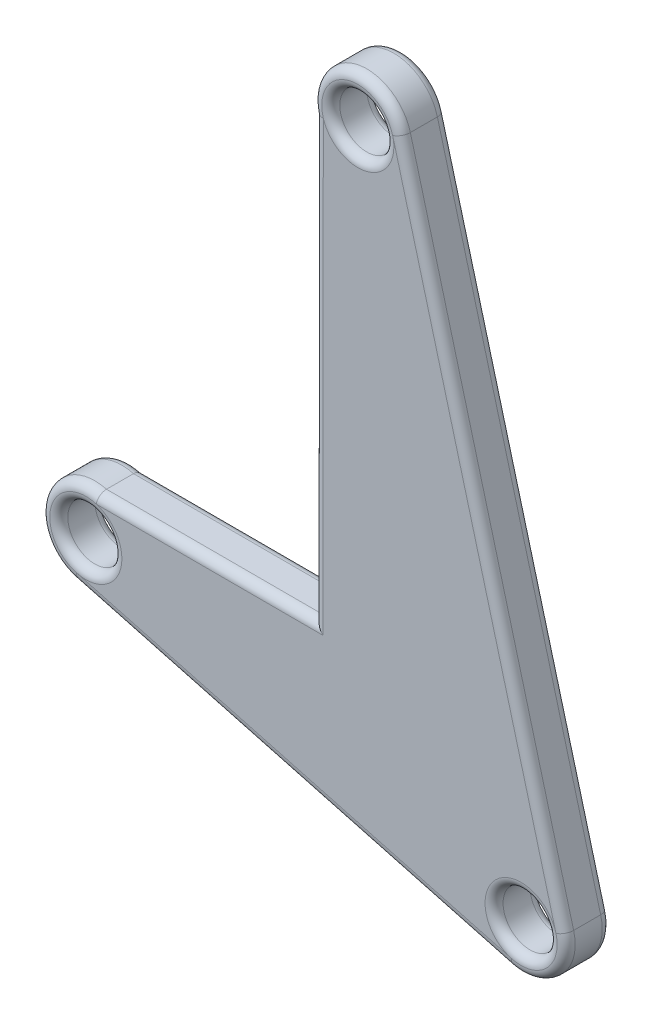
ISO-10303-21;
HEADER;
FILE_DESCRIPTION(('STEP AP214'),'2;1');
FILE_NAME('part.step','',(''),(''),'','','');
FILE_SCHEMA(('AUTOMOTIVE_DESIGN { 1 0 10303 214 1 1 1 1 }'));
ENDSEC;
DATA;
#1=APPLICATION_CONTEXT('core data for automotive mechanical design processes');
#2=APPLICATION_PROTOCOL_DEFINITION('international standard','automotive_design',2000,#1);
#3=PRODUCT_CONTEXT('',#1,'mechanical');
#4=PRODUCT('Part','Part','',(#3));
#5=PRODUCT_RELATED_PRODUCT_CATEGORY('part','',(#4));
#6=PRODUCT_DEFINITION_FORMATION('','',#4);
#7=PRODUCT_DEFINITION_CONTEXT('part definition',#1,'design');
#8=PRODUCT_DEFINITION('design','',#6,#7);
#9=PRODUCT_DEFINITION_SHAPE('','',#8);
#10=(LENGTH_UNIT() NAMED_UNIT(*) SI_UNIT(.MILLI.,.METRE.));
#11=(NAMED_UNIT(*) PLANE_ANGLE_UNIT() SI_UNIT($,.RADIAN.));
#12=(NAMED_UNIT(*) SI_UNIT($,.STERADIAN.) SOLID_ANGLE_UNIT());
#13=UNCERTAINTY_MEASURE_WITH_UNIT(LENGTH_MEASURE(1.E-05),#10,'distance_accuracy_value','');
#14=(GEOMETRIC_REPRESENTATION_CONTEXT(3) GLOBAL_UNCERTAINTY_ASSIGNED_CONTEXT((#13)) GLOBAL_UNIT_ASSIGNED_CONTEXT((#10,
#11,#12)) REPRESENTATION_CONTEXT('',''));
#15=CARTESIAN_POINT('',(0.,0.,0.));
#16=DIRECTION('',(0.,0.,1.));
#17=DIRECTION('',(1.,0.,0.));
#18=AXIS2_PLACEMENT_3D('',#15,#16,#17);
#19=CARTESIAN_POINT('',(58.3955766792557,15.6470476127568,2.5));
#20=DIRECTION('',(0.965925826289066,0.258819045102528,0.));
#21=DIRECTION('',(-0.258819045102528,0.965925826289066,0.));
#22=AXIS2_PLACEMENT_3D('',#19,#20,#21);
#23=PLANE('',#22);
#24=DIRECTION('',(0.,0.,-1.));
#25=VECTOR('',#24,1.);
#26=CARTESIAN_POINT('',(54.3763387927888,30.6470476127566,2.5));
#27=LINE('',#26,#25);
#28=CARTESIAN_POINT('',(54.3763387927888,30.6470476127566,2.));
#29=VERTEX_POINT('',#28);
#30=CARTESIAN_POINT('',(54.3763387927888,30.6470476127566,0.5));
#31=VERTEX_POINT('',#30);
#32=EDGE_CURVE('E190',#29,#31,#27,.T.);
#33=ORIENTED_EDGE('',*,*,#32,.T.);
#34=DIRECTION('',(0.258819045102528,-0.965925826289066,0.));
#35=VECTOR('',#34,1.);
#36=CARTESIAN_POINT('',(45.3176722142003,64.4544515328739,0.5));
#37=LINE('',#36,#35);
#38=CARTESIAN_POINT('',(45.3176722142003,64.4544515328739,0.5));
#39=VERTEX_POINT('',#38);
#40=EDGE_CURVE('E345',#31,#39,#37,.F.);
#41=ORIENTED_EDGE('',*,*,#40,.T.);
#42=DIRECTION('',(0.,0.,-1.));
#43=VECTOR('',#42,1.);
#44=CARTESIAN_POINT('',(45.3176722142003,64.4544515328739,2.5));
#45=LINE('',#44,#43);
#46=CARTESIAN_POINT('',(45.3176722142003,64.4544515328739,2.));
#47=VERTEX_POINT('',#46);
#48=EDGE_CURVE('E179',#47,#39,#45,.T.);
#49=ORIENTED_EDGE('',*,*,#48,.F.);
#50=DIRECTION('',(0.258819045102528,-0.965925826289066,0.));
#51=VECTOR('',#50,1.);
#52=CARTESIAN_POINT('',(58.3955766792557,15.6470476127568,2.));
#53=LINE('',#52,#51);
#54=EDGE_CURVE('E349',#47,#29,#53,.T.);
#55=ORIENTED_EDGE('',*,*,#54,.T.);
#56=EDGE_LOOP('',(#33,#41,#49,#55));
#57=FACE_BOUND('',#56,.T.);
#58=ADVANCED_FACE('F43',(#57),#23,.T.);
#59=CARTESIAN_POINT('',(42.9028576484777,63.8074039201176,2.5));
#60=DIRECTION('',(0.,0.,-1.));
#61=DIRECTION('',(-1.,0.,0.));
#62=AXIS2_PLACEMENT_3D('',#59,#60,#61);
#63=CYLINDRICAL_SURFACE('',#62,2.49999999999999);
#64=ORIENTED_EDGE('',*,*,#48,.T.);
#65=CARTESIAN_POINT('',(42.9028576484777,63.8074039201176,0.5));
#66=DIRECTION('',(0.,0.,1.));
#67=DIRECTION('',(1.,0.,0.));
#68=AXIS2_PLACEMENT_3D('',#65,#66,#67);
#69=CIRCLE('',#68,2.49999999999999);
#70=CARTESIAN_POINT('',(40.488043082755,63.1603563073612,0.5));
#71=VERTEX_POINT('',#70);
#72=EDGE_CURVE('E455',#39,#71,#69,.T.);
#73=ORIENTED_EDGE('',*,*,#72,.T.);
#74=DIRECTION('',(0.,0.,-1.));
#75=VECTOR('',#74,1.);
#76=CARTESIAN_POINT('',(40.488043082755,63.1603563073612,2.5));
#77=LINE('',#76,#75);
#78=CARTESIAN_POINT('',(40.488043082755,63.1603563073612,2.));
#79=VERTEX_POINT('',#78);
#80=EDGE_CURVE('E429',#79,#71,#77,.T.);
#81=ORIENTED_EDGE('',*,*,#80,.F.);
#82=CARTESIAN_POINT('',(42.9028576484777,63.8074039201176,2.));
#83=DIRECTION('',(0.,0.,1.));
#84=DIRECTION('',(1.,0.,0.));
#85=AXIS2_PLACEMENT_3D('',#82,#83,#84);
#86=CIRCLE('',#85,2.49999999999999);
#87=EDGE_CURVE('E453',#79,#47,#86,.F.);
#88=ORIENTED_EDGE('',*,*,#87,.T.);
#89=EDGE_LOOP('',(#64,#73,#81,#88));
#90=FACE_BOUND('',#89,.T.);
#91=ADVANCED_FACE('F288',(#90),#63,.T.);
#92=CARTESIAN_POINT('',(40.4161758500665,-0.0459542518539564,2.5));
#93=DIRECTION('',(-0.999999353586309,0.00113702548996662,0.));
#94=DIRECTION('',(-0.00113702548996662,-0.999999353586309,0.));
#95=AXIS2_PLACEMENT_3D('',#92,#93,#94);
#96=PLANE('',#95);
#97=ORIENTED_EDGE('',*,*,#80,.T.);
#98=DIRECTION('',(0.00113702548996662,0.999999353586309,0.));
#99=VECTOR('',#98,1.);
#100=CARTESIAN_POINT('',(40.4604261825957,38.8716463785862,0.5));
#101=LINE('',#100,#99);
#102=CARTESIAN_POINT('',(40.4604261825957,38.8716463785862,0.5));
#103=VERTEX_POINT('',#102);
#104=EDGE_CURVE('E193',#71,#103,#101,.F.);
#105=ORIENTED_EDGE('',*,*,#104,.T.);
#106=DIRECTION('',(0.,0.,-1.));
#107=VECTOR('',#106,1.);
#108=CARTESIAN_POINT('',(40.4604261825957,38.8716463785862,2.5));
#109=LINE('',#108,#107);
#110=CARTESIAN_POINT('',(40.4604261825957,38.8716463785862,2.));
#111=VERTEX_POINT('',#110);
#112=EDGE_CURVE('E426',#111,#103,#109,.T.);
#113=ORIENTED_EDGE('',*,*,#112,.F.);
#114=DIRECTION('',(0.00113702548996662,0.999999353586309,0.));
#115=VECTOR('',#114,1.);
#116=CARTESIAN_POINT('',(40.4161758500665,-0.0459542518539564,2.));
#117=LINE('',#116,#115);
#118=EDGE_CURVE('E457',#111,#79,#117,.T.);
#119=ORIENTED_EDGE('',*,*,#118,.T.);
#120=EDGE_LOOP('',(#97,#105,#113,#119));
#121=FACE_BOUND('',#120,.T.);
#122=ADVANCED_FACE('F294',(#121),#96,.T.);
#123=CARTESIAN_POINT('',(0.0442503325291617,38.9176006304402,2.5));
#124=DIRECTION('',(0.00113702548996635,0.999999353586309,0.));
#125=DIRECTION('',(-0.999999353586309,0.00113702548996635,0.));
#126=AXIS2_PLACEMENT_3D('',#123,#124,#125);
#127=PLANE('',#126);
#128=ORIENTED_EDGE('',*,*,#112,.T.);
#129=DIRECTION('',(0.999999353586309,-0.00113702548996635,0.));
#130=VECTOR('',#129,1.);
#131=CARTESIAN_POINT('',(28.4604261825957,38.8852906932857,0.5));
#132=LINE('',#131,#130);
#133=CARTESIAN_POINT('',(28.4604261825957,38.8852906932857,0.5));
#134=VERTEX_POINT('',#133);
#135=EDGE_CURVE('E462',#103,#134,#132,.F.);
#136=ORIENTED_EDGE('',*,*,#135,.T.);
#137=DIRECTION('',(0.,0.,-1.));
#138=VECTOR('',#137,1.);
#139=CARTESIAN_POINT('',(28.4604261825957,38.8852906932857,2.5));
#140=LINE('',#139,#138);
#141=CARTESIAN_POINT('',(28.4604261825957,38.8852906932857,2.));
#142=VERTEX_POINT('',#141);
#143=EDGE_CURVE('E420',#142,#134,#140,.T.);
#144=ORIENTED_EDGE('',*,*,#143,.F.);
#145=DIRECTION('',(0.999999353586309,-0.00113702548996635,0.));
#146=VECTOR('',#145,1.);
#147=CARTESIAN_POINT('',(0.0442503325291617,38.9176006304402,2.));
#148=LINE('',#147,#146);
#149=EDGE_CURVE('E460',#142,#111,#148,.T.);
#150=ORIENTED_EDGE('',*,*,#149,.T.);
#151=EDGE_LOOP('',(#128,#136,#144,#150));
#152=FACE_BOUND('',#151,.T.);
#153=ADVANCED_FACE('F503',(#152),#127,.T.);
#154=CARTESIAN_POINT('',(27.8133785698394,36.470476127563,2.5));
#155=DIRECTION('',(0.,0.,-1.));
#156=DIRECTION('',(-1.,0.,0.));
#157=AXIS2_PLACEMENT_3D('',#154,#155,#156);
#158=CYLINDRICAL_SURFACE('',#157,2.49999999999999);
#159=ORIENTED_EDGE('',*,*,#143,.T.);
#160=CARTESIAN_POINT('',(27.8133785698394,36.470476127563,0.5));
#161=DIRECTION('',(0.,0.,1.));
#162=DIRECTION('',(1.,0.,0.));
#163=AXIS2_PLACEMENT_3D('',#160,#161,#162);
#164=CIRCLE('',#163,2.49999999999999);
#165=CARTESIAN_POINT('',(27.1663309570831,34.0556615618403,0.5));
#166=VERTEX_POINT('',#165);
#167=EDGE_CURVE('E466',#134,#166,#164,.T.);
#168=ORIENTED_EDGE('',*,*,#167,.T.);
#169=DIRECTION('',(0.,0.,-1.));
#170=VECTOR('',#169,1.);
#171=CARTESIAN_POINT('',(27.1663309570831,34.0556615618403,2.5));
#172=LINE('',#171,#170);
#173=CARTESIAN_POINT('',(27.1663309570831,34.0556615618403,2.));
#174=VERTEX_POINT('',#173);
#175=EDGE_CURVE('E418',#174,#166,#172,.T.);
#176=ORIENTED_EDGE('',*,*,#175,.F.);
#177=CARTESIAN_POINT('',(27.8133785698394,36.470476127563,2.));
#178=DIRECTION('',(0.,0.,1.));
#179=DIRECTION('',(1.,0.,0.));
#180=AXIS2_PLACEMENT_3D('',#177,#178,#179);
#181=CIRCLE('',#180,2.49999999999999);
#182=EDGE_CURVE('E464',#174,#142,#181,.F.);
#183=ORIENTED_EDGE('',*,*,#182,.T.);
#184=EDGE_LOOP('',(#159,#168,#176,#183));
#185=FACE_BOUND('',#184,.T.);
#186=ADVANCED_FACE('F500',(#185),#158,.T.);
#187=CARTESIAN_POINT('',(10.3337145007764,38.5659475478104,2.5));
#188=DIRECTION('',(0.258819045102511,0.965925826289071,0.));
#189=DIRECTION('',(-0.965925826289071,0.258819045102511,0.));
#190=AXIS2_PLACEMENT_3D('',#187,#188,#189);
#191=PLANE('',#190);
#192=ORIENTED_EDGE('',*,*,#175,.T.);
#193=DIRECTION('',(0.965925826289071,-0.258819045102511,0.));
#194=VECTOR('',#193,1.);
#195=CARTESIAN_POINT('',(10.3337145007764,38.5659475478104,0.5));
#196=LINE('',#195,#194);
#197=CARTESIAN_POINT('',(51.3144766143099,27.5851854342776,0.5));
#198=VERTEX_POINT('',#197);
#199=EDGE_CURVE('E411',#166,#198,#196,.T.);
#200=ORIENTED_EDGE('',*,*,#199,.T.);
#201=DIRECTION('',(0.,0.,-1.));
#202=VECTOR('',#201,1.);
#203=CARTESIAN_POINT('',(51.3144766143099,27.5851854342776,2.5));
#204=LINE('',#203,#202);
#205=CARTESIAN_POINT('',(51.3144766143099,27.5851854342776,2.));
#206=VERTEX_POINT('',#205);
#207=EDGE_CURVE('E410',#206,#198,#204,.T.);
#208=ORIENTED_EDGE('',*,*,#207,.F.);
#209=DIRECTION('',(0.965925826289071,-0.258819045102511,0.));
#210=VECTOR('',#209,1.);
#211=CARTESIAN_POINT('',(27.1663309570831,34.0556615618403,2.));
#212=LINE('',#211,#210);
#213=EDGE_CURVE('E405',#206,#174,#212,.F.);
#214=ORIENTED_EDGE('',*,*,#213,.T.);
#215=EDGE_LOOP('',(#192,#200,#208,#214));
#216=FACE_BOUND('',#215,.T.);
#217=ADVANCED_FACE('F415',(#216),#191,.F.);
#218=CARTESIAN_POINT('',(51.9615242270662,30.0000000000003,2.5));
#219=DIRECTION('',(0.,0.,-1.));
#220=DIRECTION('',(-1.,0.,0.));
#221=AXIS2_PLACEMENT_3D('',#218,#219,#220);
#222=CYLINDRICAL_SURFACE('',#221,1.50000000000001);
#223=CARTESIAN_POINT('',(51.9615242270662,30.0000000000003,0.5));
#224=DIRECTION('',(0.,0.,1.));
#225=DIRECTION('',(1.,0.,0.));
#226=AXIS2_PLACEMENT_3D('',#223,#224,#225);
#227=CIRCLE('',#226,1.50000000000001);
#228=CARTESIAN_POINT('',(53.4615242270662,30.0000000000003,0.5));
#229=VERTEX_POINT('',#228);
#230=EDGE_CURVE('E450',#229,#229,#227,.F.);
#231=ORIENTED_EDGE('',*,*,#230,.T.);
#232=EDGE_LOOP('',(#231));
#233=FACE_BOUND('',#232,.T.);
#234=CARTESIAN_POINT('',(51.9615242270662,30.0000000000003,2.));
#235=DIRECTION('',(0.,0.,1.));
#236=DIRECTION('',(1.,0.,0.));
#237=AXIS2_PLACEMENT_3D('',#234,#235,#236);
#238=CIRCLE('',#237,1.50000000000001);
#239=CARTESIAN_POINT('',(53.4615242270662,30.0000000000003,2.));
#240=VERTEX_POINT('',#239);
#241=EDGE_CURVE('E447',#240,#240,#238,.T.);
#242=ORIENTED_EDGE('',*,*,#241,.T.);
#243=EDGE_LOOP('',(#242));
#244=FACE_BOUND('',#243,.T.);
#245=ADVANCED_FACE('F492',(#233,#244),#222,.F.);
#246=CARTESIAN_POINT('',(51.9615242270662,30.0000000000002,2.5));
#247=DIRECTION('',(0.,0.,-1.));
#248=DIRECTION('',(-1.,0.,0.));
#249=AXIS2_PLACEMENT_3D('',#246,#247,#248);
#250=CYLINDRICAL_SURFACE('',#249,2.5);
#251=ORIENTED_EDGE('',*,*,#207,.T.);
#252=CARTESIAN_POINT('',(51.9615242270662,30.0000000000002,0.5));
#253=DIRECTION('',(0.,0.,1.));
#254=DIRECTION('',(1.,0.,0.));
#255=AXIS2_PLACEMENT_3D('',#252,#253,#254);
#256=CIRCLE('',#255,2.5);
#257=EDGE_CURVE('E354',#198,#31,#256,.T.);
#258=ORIENTED_EDGE('',*,*,#257,.T.);
#259=ORIENTED_EDGE('',*,*,#32,.F.);
#260=CARTESIAN_POINT('',(51.9615242270662,30.0000000000002,2.));
#261=DIRECTION('',(0.,0.,1.));
#262=DIRECTION('',(1.,0.,0.));
#263=AXIS2_PLACEMENT_3D('',#260,#261,#262);
#264=CIRCLE('',#263,2.5);
#265=EDGE_CURVE('E394',#29,#206,#264,.F.);
#266=ORIENTED_EDGE('',*,*,#265,.T.);
#267=EDGE_LOOP('',(#251,#258,#259,#266));
#268=FACE_BOUND('',#267,.T.);
#269=ADVANCED_FACE('F304',(#268),#250,.T.);
#270=CARTESIAN_POINT('',(42.9028576484777,63.8074039201176,2.5));
#271=DIRECTION('',(0.,0.,-1.));
#272=DIRECTION('',(-1.,0.,0.));
#273=AXIS2_PLACEMENT_3D('',#270,#271,#272);
#274=CYLINDRICAL_SURFACE('',#273,1.5);
#275=CARTESIAN_POINT('',(42.9028576484777,63.8074039201176,0.5));
#276=DIRECTION('',(0.,0.,1.));
#277=DIRECTION('',(1.,0.,0.));
#278=AXIS2_PLACEMENT_3D('',#275,#276,#277);
#279=CIRCLE('',#278,1.5);
#280=CARTESIAN_POINT('',(44.4028576484777,63.8074039201176,0.5));
#281=VERTEX_POINT('',#280);
#282=EDGE_CURVE('E352',#281,#281,#279,.F.);
#283=ORIENTED_EDGE('',*,*,#282,.T.);
#284=EDGE_LOOP('',(#283));
#285=FACE_BOUND('',#284,.T.);
#286=CARTESIAN_POINT('',(42.9028576484777,63.8074039201176,2.));
#287=DIRECTION('',(0.,0.,1.));
#288=DIRECTION('',(1.,0.,0.));
#289=AXIS2_PLACEMENT_3D('',#286,#287,#288);
#290=CIRCLE('',#289,1.5);
#291=CARTESIAN_POINT('',(44.4028576484777,63.8074039201176,2.));
#292=VERTEX_POINT('',#291);
#293=EDGE_CURVE('E348',#292,#292,#290,.T.);
#294=ORIENTED_EDGE('',*,*,#293,.T.);
#295=EDGE_LOOP('',(#294));
#296=FACE_BOUND('',#295,.T.);
#297=ADVANCED_FACE('F300',(#285,#296),#274,.F.);
#298=CARTESIAN_POINT('',(27.8133785698394,36.470476127563,2.5));
#299=DIRECTION('',(0.,0.,-1.));
#300=DIRECTION('',(-1.,0.,0.));
#301=AXIS2_PLACEMENT_3D('',#298,#299,#300);
#302=CYLINDRICAL_SURFACE('',#301,1.50000000000002);
#303=CARTESIAN_POINT('',(27.8133785698394,36.470476127563,0.5));
#304=DIRECTION('',(0.,0.,1.));
#305=DIRECTION('',(1.,0.,0.));
#306=AXIS2_PLACEMENT_3D('',#303,#304,#305);
#307=CIRCLE('',#306,1.50000000000002);
#308=CARTESIAN_POINT('',(29.3133785698394,36.470476127563,0.5));
#309=VERTEX_POINT('',#308);
#310=EDGE_CURVE('E444',#309,#309,#307,.F.);
#311=ORIENTED_EDGE('',*,*,#310,.T.);
#312=EDGE_LOOP('',(#311));
#313=FACE_BOUND('',#312,.T.);
#314=CARTESIAN_POINT('',(27.8133785698394,36.470476127563,2.));
#315=DIRECTION('',(0.,0.,1.));
#316=DIRECTION('',(1.,0.,0.));
#317=AXIS2_PLACEMENT_3D('',#314,#315,#316);
#318=CIRCLE('',#317,1.50000000000002);
#319=CARTESIAN_POINT('',(29.3133785698394,36.470476127563,2.));
#320=VERTEX_POINT('',#319);
#321=EDGE_CURVE('E441',#320,#320,#318,.T.);
#322=ORIENTED_EDGE('',*,*,#321,.T.);
#323=EDGE_LOOP('',(#322));
#324=FACE_BOUND('',#323,.T.);
#325=ADVANCED_FACE('F303',(#313,#324),#302,.F.);
#326=CARTESIAN_POINT('',(0.,0.,2.5));
#327=DIRECTION('',(0.,0.,1.));
#328=DIRECTION('',(1.,0.,0.));
#329=AXIS2_PLACEMENT_3D('',#326,#327,#328);
#330=PLANE('',#329);
#331=CARTESIAN_POINT('',(27.8133785698394,36.470476127563,2.5));
#332=DIRECTION('',(0.,0.,1.));
#333=DIRECTION('',(1.,0.,0.));
#334=AXIS2_PLACEMENT_3D('',#331,#332,#333);
#335=CIRCLE('',#334,2.00000000000002);
#336=CARTESIAN_POINT('',(29.8133785698394,36.470476127563,2.5));
#337=VERTEX_POINT('',#336);
#338=CARTESIAN_POINT('',(27.2957404796344,34.5386244749849,2.5));
#339=VERTEX_POINT('',#338);
#340=EDGE_CURVE('E52',#337,#339,#335,.F.);
#341=ORIENTED_EDGE('',*,*,#340,.T.);
#342=DIRECTION('',(0.965925826289071,-0.258819045102511,0.));
#343=VECTOR('',#342,1.);
#344=CARTESIAN_POINT('',(51.4438861368611,28.0681483474221,2.5));
#345=LINE('',#344,#343);
#346=CARTESIAN_POINT('',(51.4438861368611,28.0681483474221,2.5));
#347=VERTEX_POINT('',#346);
#348=EDGE_CURVE('E11',#339,#347,#345,.T.);
#349=ORIENTED_EDGE('',*,*,#348,.T.);
#350=CARTESIAN_POINT('',(51.9615242270662,30.0000000000003,2.5));
#351=DIRECTION('',(0.,0.,1.));
#352=DIRECTION('',(1.,0.,0.));
#353=AXIS2_PLACEMENT_3D('',#350,#351,#352);
#354=CIRCLE('',#353,2.00000000000001);
#355=CARTESIAN_POINT('',(53.8933758796443,30.5176380902053,2.5));
#356=VERTEX_POINT('',#355);
#357=EDGE_CURVE('E370',#347,#356,#354,.F.);
#358=ORIENTED_EDGE('',*,*,#357,.T.);
#359=DIRECTION('',(0.258819045102528,-0.965925826289066,0.));
#360=VECTOR('',#359,1.);
#361=CARTESIAN_POINT('',(57.9126137661112,15.5176380902055,2.5));
#362=LINE('',#361,#360);
#363=CARTESIAN_POINT('',(44.8347093010558,64.3250420103226,2.5));
#364=VERTEX_POINT('',#363);
#365=EDGE_CURVE('E364',#356,#364,#362,.F.);
#366=ORIENTED_EDGE('',*,*,#365,.T.);
#367=CARTESIAN_POINT('',(42.9028576484777,63.8074039201176,2.5));
#368=DIRECTION('',(0.,0.,1.));
#369=DIRECTION('',(1.,0.,0.));
#370=AXIS2_PLACEMENT_3D('',#367,#368,#369);
#371=CIRCLE('',#370,2.);
#372=CARTESIAN_POINT('',(44.9028576484777,63.8074039201176,2.5));
#373=VERTEX_POINT('',#372);
#374=EDGE_CURVE('E360',#364,#373,#371,.F.);
#375=ORIENTED_EDGE('',*,*,#374,.T.);
#376=CARTESIAN_POINT('',(42.9028576484777,63.8074039201176,2.5));
#377=DIRECTION('',(0.,0.,1.));
#378=DIRECTION('',(1.,0.,0.));
#379=AXIS2_PLACEMENT_3D('',#376,#377,#378);
#380=CIRCLE('',#379,2.);
#381=CARTESIAN_POINT('',(40.9881222059326,63.2296598720636,2.5));
#382=VERTEX_POINT('',#381);
#383=EDGE_CURVE('E362',#373,#382,#380,.F.);
#384=ORIENTED_EDGE('',*,*,#383,.T.);
#385=DIRECTION('',(0.00113702548996662,0.999999353586309,0.));
#386=VECTOR('',#385,1.);
#387=CARTESIAN_POINT('',(40.9161755268596,-0.0465227645989397,2.5));
#388=LINE('',#387,#386);
#389=CARTESIAN_POINT('',(40.9598573466438,38.3710781890481,2.5));
#390=VERTEX_POINT('',#389);
#391=EDGE_CURVE('E366',#382,#390,#388,.F.);
#392=ORIENTED_EDGE('',*,*,#391,.T.);
#393=DIRECTION('',(0.999999353586309,-0.00113702548996635,0.));
#394=VECTOR('',#393,1.);
#395=CARTESIAN_POINT('',(0.0436818197841786,38.417600953647,2.5));
#396=LINE('',#395,#394);
#397=CARTESIAN_POINT('',(28.3905980702547,38.3853697664736,2.5));
#398=VERTEX_POINT('',#397);
#399=EDGE_CURVE('E368',#390,#398,#396,.F.);
#400=ORIENTED_EDGE('',*,*,#399,.T.);
#401=CARTESIAN_POINT('',(27.8133785698394,36.470476127563,2.5));
#402=DIRECTION('',(0.,0.,1.));
#403=DIRECTION('',(1.,0.,0.));
#404=AXIS2_PLACEMENT_3D('',#401,#402,#403);
#405=CIRCLE('',#404,2.00000000000002);
#406=EDGE_CURVE('E67',#398,#337,#405,.F.);
#407=ORIENTED_EDGE('',*,*,#406,.T.);
#408=EDGE_LOOP('',(#341,#349,#358,#366,#375,#384,#392,#400,#407));
#409=FACE_BOUND('',#408,.T.);
#410=ADVANCED_FACE('F399',(#409),#330,.T.);
#411=CARTESIAN_POINT('',(0.,0.,0.));
#412=DIRECTION('',(0.,0.,1.));
#413=DIRECTION('',(1.,0.,0.));
#414=AXIS2_PLACEMENT_3D('',#411,#412,#413);
#415=PLANE('',#414);
#416=CARTESIAN_POINT('',(27.8133785698394,36.470476127563,0.));
#417=DIRECTION('',(0.,0.,1.));
#418=DIRECTION('',(1.,0.,0.));
#419=AXIS2_PLACEMENT_3D('',#416,#417,#418);
#420=CIRCLE('',#419,2.00000000000002);
#421=CARTESIAN_POINT('',(27.2957404796344,34.5386244749849,0.));
#422=VERTEX_POINT('',#421);
#423=CARTESIAN_POINT('',(29.8133785698394,36.470476127563,0.));
#424=VERTEX_POINT('',#423);
#425=EDGE_CURVE('E437',#422,#424,#420,.T.);
#426=ORIENTED_EDGE('',*,*,#425,.T.);
#427=CARTESIAN_POINT('',(27.8133785698394,36.470476127563,0.));
#428=DIRECTION('',(0.,0.,1.));
#429=DIRECTION('',(1.,0.,0.));
#430=AXIS2_PLACEMENT_3D('',#427,#428,#429);
#431=CIRCLE('',#430,2.00000000000002);
#432=CARTESIAN_POINT('',(28.3905980702547,38.3853697664736,0.));
#433=VERTEX_POINT('',#432);
#434=EDGE_CURVE('E439',#424,#433,#431,.T.);
#435=ORIENTED_EDGE('',*,*,#434,.T.);
#436=DIRECTION('',(0.999999353586309,-0.00113702548996635,0.));
#437=VECTOR('',#436,1.);
#438=CARTESIAN_POINT('',(40.4598576698507,38.3716467017931,0.));
#439=LINE('',#438,#437);
#440=CARTESIAN_POINT('',(40.9598573466438,38.3710781890481,0.));
#441=VERTEX_POINT('',#440);
#442=EDGE_CURVE('E164',#433,#441,#439,.T.);
#443=ORIENTED_EDGE('',*,*,#442,.T.);
#444=DIRECTION('',(0.00113702548996662,0.999999353586309,0.));
#445=VECTOR('',#444,1.);
#446=CARTESIAN_POINT('',(40.9880427595482,63.1597877946163,0.));
#447=LINE('',#446,#445);
#448=CARTESIAN_POINT('',(40.9881222059326,63.2296598720636,0.));
#449=VERTEX_POINT('',#448);
#450=EDGE_CURVE('E157',#441,#449,#447,.T.);
#451=ORIENTED_EDGE('',*,*,#450,.T.);
#452=CARTESIAN_POINT('',(42.9028576484777,63.8074039201176,0.));
#453=DIRECTION('',(0.,0.,1.));
#454=DIRECTION('',(1.,0.,0.));
#455=AXIS2_PLACEMENT_3D('',#452,#453,#454);
#456=CIRCLE('',#455,2.);
#457=CARTESIAN_POINT('',(44.9028576484777,63.8074039201176,0.));
#458=VERTEX_POINT('',#457);
#459=EDGE_CURVE('E160',#449,#458,#456,.T.);
#460=ORIENTED_EDGE('',*,*,#459,.T.);
#461=CARTESIAN_POINT('',(42.9028576484777,63.8074039201176,0.));
#462=DIRECTION('',(0.,0.,1.));
#463=DIRECTION('',(1.,0.,0.));
#464=AXIS2_PLACEMENT_3D('',#461,#462,#463);
#465=CIRCLE('',#464,2.);
#466=CARTESIAN_POINT('',(44.8347093010558,64.3250420103226,0.));
#467=VERTEX_POINT('',#466);
#468=EDGE_CURVE('E178',#458,#467,#465,.T.);
#469=ORIENTED_EDGE('',*,*,#468,.T.);
#470=DIRECTION('',(0.258819045102528,-0.965925826289066,0.));
#471=VECTOR('',#470,1.);
#472=CARTESIAN_POINT('',(53.8933758796443,30.5176380902053,0.));
#473=LINE('',#472,#471);
#474=CARTESIAN_POINT('',(53.8933758796443,30.5176380902053,0.));
#475=VERTEX_POINT('',#474);
#476=EDGE_CURVE('E170',#467,#475,#473,.T.);
#477=ORIENTED_EDGE('',*,*,#476,.T.);
#478=CARTESIAN_POINT('',(51.9615242270662,30.0000000000003,0.));
#479=DIRECTION('',(0.,0.,1.));
#480=DIRECTION('',(1.,0.,0.));
#481=AXIS2_PLACEMENT_3D('',#478,#479,#480);
#482=CIRCLE('',#481,2.00000000000001);
#483=CARTESIAN_POINT('',(51.4438861368611,28.0681483474221,0.));
#484=VERTEX_POINT('',#483);
#485=EDGE_CURVE('E169',#475,#484,#482,.T.);
#486=ORIENTED_EDGE('',*,*,#485,.T.);
#487=DIRECTION('',(0.965925826289071,-0.258819045102511,0.));
#488=VECTOR('',#487,1.);
#489=CARTESIAN_POINT('',(10.4631240233277,39.0489104609549,0.));
#490=LINE('',#489,#488);
#491=EDGE_CURVE('E342',#484,#422,#490,.F.);
#492=ORIENTED_EDGE('',*,*,#491,.T.);
#493=EDGE_LOOP('',(#426,#435,#443,#451,#460,#469,#477,#486,#492));
#494=FACE_BOUND('',#493,.T.);
#495=ADVANCED_FACE('F159',(#494),#415,.F.);
#496=CARTESIAN_POINT('',(42.9028576484777,63.8074039201176,0.5));
#497=DIRECTION('',(0.,0.,1.));
#498=DIRECTION('',(1.,0.,0.));
#499=AXIS2_PLACEMENT_3D('',#496,#497,#498);
#500=TOROIDAL_SURFACE('',#499,2.,0.5);
#501=ORIENTED_EDGE('',*,*,#282,.F.);
#502=EDGE_LOOP('',(#501));
#503=FACE_BOUND('',#502,.T.);
#504=CARTESIAN_POINT('',(42.9028576484777,63.8074039201176,0.));
#505=DIRECTION('',(0.,0.,1.));
#506=DIRECTION('',(1.,0.,0.));
#507=AXIS2_PLACEMENT_3D('',#504,#505,#506);
#508=CIRCLE('',#507,2.);
#509=EDGE_CURVE('E176',#467,#449,#508,.T.);
#510=ORIENTED_EDGE('',*,*,#509,.F.);
#511=ORIENTED_EDGE('',*,*,#468,.F.);
#512=ORIENTED_EDGE('',*,*,#459,.F.);
#513=EDGE_LOOP('',(#510,#511,#512));
#514=FACE_BOUND('',#513,.T.);
#515=ADVANCED_FACE('F175',(#503,#514),#500,.T.);
#516=CARTESIAN_POINT('',(42.9028576484777,63.8074039201176,0.5));
#517=DIRECTION('',(0.,0.,1.));
#518=DIRECTION('',(1.,0.,0.));
#519=AXIS2_PLACEMENT_3D('',#516,#517,#518);
#520=TOROIDAL_SURFACE('',#519,1.99999999999999,0.5);
#521=CARTESIAN_POINT('',(40.488043082755,63.1603563073612,0.5));
#522=CARTESIAN_POINT('',(40.4880183685697,63.1603539696288,0.472052985674048));
#523=CARTESIAN_POINT('',(40.490385021512,63.1606632936999,0.44411440903763));
#524=CARTESIAN_POINT('',(40.4997175074952,63.1618878262976,0.389055911693966));
#525=CARTESIAN_POINT('',(40.5066789769882,63.1628024599836,0.361935239776873));
#526=CARTESIAN_POINT('',(40.5250218477877,63.1652207164619,0.30924784797443));
#527=CARTESIAN_POINT('',(40.5364050168104,63.1667245748178,0.28368175431518));
#528=CARTESIAN_POINT('',(40.5632443172956,63.1702879540234,0.234835272321857));
#529=CARTESIAN_POINT('',(40.5786997444701,63.1723473787906,0.21155448970295));
#530=CARTESIAN_POINT('',(40.613295794279,63.1769859155969,0.1678404448808));
#531=CARTESIAN_POINT('',(40.6324491180124,63.179566820218,0.14741742766105));
#532=CARTESIAN_POINT('',(40.6738582959438,63.1851882261486,0.110067216264351));
#533=CARTESIAN_POINT('',(40.6961152124796,63.188228884859,0.0931412240381968));
#534=CARTESIAN_POINT('',(40.7432890401307,63.1947285085515,0.0631193055503686));
#535=CARTESIAN_POINT('',(40.7682269184119,63.1981908038697,0.0500570950934792));
#536=CARTESIAN_POINT('',(40.8198890700804,63.2054320193215,0.0283108314023206));
#537=CARTESIAN_POINT('',(40.8466120022525,63.2092107022638,0.0196235320337576));
#538=CARTESIAN_POINT('',(40.8912389541093,63.215585920509,0.0091463821764209));
#539=CARTESIAN_POINT('',(40.9088471703732,63.2181172311224,0.00599887782570749));
#540=CARTESIAN_POINT('',(40.9442719139869,63.2232441427352,0.0016074483691028));
#541=CARTESIAN_POINT('',(40.9620880721333,63.2258396369013,0.000360551367850168));
#542=CARTESIAN_POINT('',(40.9826443284736,63.2288550420574,2.24488267530319E-05));
#543=CARTESIAN_POINT('',(40.9853834675642,63.2292572720157,-5.96479213260694E-08));
#544=CARTESIAN_POINT('',(40.9881222059326,63.2296598720636,0.));
#545=B_SPLINE_CURVE_WITH_KNOTS('',3,(#521,#522,#523,#524,#525,#526,#527,#528,#529,#530,#531,
#532,#533,#534,#535,#536,#537,#538,#539,#540,#541,#542,#543,#544),.UNSPECIFIED.,.F.,.F.,(4,2,2,
2,2,2,2,2,2,2,2,4),(0.,0.0837269700381595,0.167374541480565,0.251055588195157,0.334722171945158,
0.418681407323397,0.502669452219327,0.587370117408182,0.672007842726211,0.726116645895338,
0.780140754421471,0.788446144027912),.UNSPECIFIED.);
#546=EDGE_CURVE('E185',#71,#449,#545,.T.);
#547=ORIENTED_EDGE('',*,*,#546,.F.);
#548=ORIENTED_EDGE('',*,*,#72,.F.);
#549=CARTESIAN_POINT('',(44.8347093010558,64.3250420103226,0.5));
#550=DIRECTION('',(0.258819045102525,-0.965925826289067,0.));
#551=DIRECTION('',(0.965925826289067,0.258819045102525,0.));
#552=AXIS2_PLACEMENT_3D('',#549,#550,#551);
#553=CIRCLE('',#552,0.5);
#554=EDGE_CURVE('E188',#467,#39,#553,.T.);
#555=ORIENTED_EDGE('',*,*,#554,.F.);
#556=ORIENTED_EDGE('',*,*,#509,.T.);
#557=EDGE_LOOP('',(#547,#548,#555,#556));
#558=FACE_BOUND('',#557,.T.);
#559=ADVANCED_FACE('F183',(#558),#520,.T.);
#560=CARTESIAN_POINT('',(57.9126137661112,15.5176380902055,0.5));
#561=DIRECTION('',(-0.258819045102528,0.965925826289066,0.));
#562=DIRECTION('',(-0.965925826289066,-0.258819045102528,0.));
#563=AXIS2_PLACEMENT_3D('',#560,#561,#562);
#564=CYLINDRICAL_SURFACE('',#563,0.5);
#565=ORIENTED_EDGE('',*,*,#554,.T.);
#566=ORIENTED_EDGE('',*,*,#40,.F.);
#567=CARTESIAN_POINT('',(53.8933758796443,30.5176380902053,0.5));
#568=DIRECTION('',(0.258819045102532,-0.965925826289065,0.));
#569=DIRECTION('',(0.965925826289066,0.258819045102532,0.));
#570=AXIS2_PLACEMENT_3D('',#567,#568,#569);
#571=CIRCLE('',#570,0.5);
#572=EDGE_CURVE('E194',#475,#31,#571,.T.);
#573=ORIENTED_EDGE('',*,*,#572,.F.);
#574=ORIENTED_EDGE('',*,*,#476,.F.);
#575=EDGE_LOOP('',(#565,#566,#573,#574));
#576=FACE_BOUND('',#575,.T.);
#577=ADVANCED_FACE('F216',(#576),#564,.T.);
#578=CARTESIAN_POINT('',(51.9615242270662,30.0000000000003,0.5));
#579=DIRECTION('',(0.,0.,1.));
#580=DIRECTION('',(1.,0.,0.));
#581=AXIS2_PLACEMENT_3D('',#578,#579,#580);
#582=TOROIDAL_SURFACE('',#581,2.00000000000001,0.5);
#583=ORIENTED_EDGE('',*,*,#230,.F.);
#584=EDGE_LOOP('',(#583));
#585=FACE_BOUND('',#584,.T.);
#586=CARTESIAN_POINT('',(51.9615242270662,30.0000000000003,0.));
#587=DIRECTION('',(0.,0.,1.));
#588=DIRECTION('',(1.,0.,0.));
#589=AXIS2_PLACEMENT_3D('',#586,#587,#588);
#590=CIRCLE('',#589,2.00000000000001);
#591=EDGE_CURVE('E198',#484,#475,#590,.T.);
#592=ORIENTED_EDGE('',*,*,#591,.F.);
#593=ORIENTED_EDGE('',*,*,#485,.F.);
#594=EDGE_LOOP('',(#592,#593));
#595=FACE_BOUND('',#594,.T.);
#596=ADVANCED_FACE('F213',(#585,#595),#582,.T.);
#597=CARTESIAN_POINT('',(40.9161755268596,-0.0465227645989397,0.5));
#598=DIRECTION('',(-0.00113702548996662,-0.999999353586309,0.));
#599=DIRECTION('',(0.999999353586309,-0.00113702548996662,0.));
#600=AXIS2_PLACEMENT_3D('',#597,#598,#599);
#601=CYLINDRICAL_SURFACE('',#600,0.5);
#602=ORIENTED_EDGE('',*,*,#546,.T.);
#603=ORIENTED_EDGE('',*,*,#450,.F.);
#604=CARTESIAN_POINT('',(40.9598573466438,38.3710781890481,0.5));
#605=DIRECTION('',(-0.70791032253738,-0.706302325668706,0.));
#606=DIRECTION('',(0.706302325668706,-0.70791032253738,0.));
#607=AXIS2_PLACEMENT_3D('',#604,#605,#606);
#608=ELLIPSE('',#607,0.707106781186547,0.5);
#609=EDGE_CURVE('E332',#103,#441,#608,.T.);
#610=ORIENTED_EDGE('',*,*,#609,.F.);
#611=ORIENTED_EDGE('',*,*,#104,.F.);
#612=EDGE_LOOP('',(#602,#603,#610,#611));
#613=FACE_BOUND('',#612,.T.);
#614=ADVANCED_FACE('F192',(#613),#601,.T.);
#615=CARTESIAN_POINT('',(51.9615242270662,30.0000000000002,0.5));
#616=DIRECTION('',(0.,0.,1.));
#617=DIRECTION('',(1.,0.,0.));
#618=AXIS2_PLACEMENT_3D('',#615,#616,#617);
#619=TOROIDAL_SURFACE('',#618,2.,0.5);
#620=ORIENTED_EDGE('',*,*,#572,.T.);
#621=ORIENTED_EDGE('',*,*,#257,.F.);
#622=CARTESIAN_POINT('',(51.4438861368612,28.0681483474221,0.5));
#623=DIRECTION('',(-0.965925826289071,0.258819045102512,0.));
#624=DIRECTION('',(-0.258819045102512,-0.965925826289071,0.));
#625=AXIS2_PLACEMENT_3D('',#622,#623,#624);
#626=CIRCLE('',#625,0.5);
#627=EDGE_CURVE('E327',#484,#198,#626,.T.);
#628=ORIENTED_EDGE('',*,*,#627,.F.);
#629=ORIENTED_EDGE('',*,*,#591,.T.);
#630=EDGE_LOOP('',(#620,#621,#628,#629));
#631=FACE_BOUND('',#630,.T.);
#632=ADVANCED_FACE('F212',(#631),#619,.T.);
#633=CARTESIAN_POINT('',(0.0436818197841786,38.417600953647,0.5));
#634=DIRECTION('',(-0.999999353586309,0.00113702548996635,0.));
#635=DIRECTION('',(-0.00113702548996635,-0.999999353586309,0.));
#636=AXIS2_PLACEMENT_3D('',#633,#634,#635);
#637=CYLINDRICAL_SURFACE('',#636,0.5);
#638=ORIENTED_EDGE('',*,*,#609,.T.);
#639=ORIENTED_EDGE('',*,*,#442,.F.);
#640=CARTESIAN_POINT('',(28.4604261825957,38.8852906932857,0.5));
#641=CARTESIAN_POINT('',(28.4604285538041,38.8853153882937,0.472049872792142));
#642=CARTESIAN_POINT('',(28.4601165108888,38.8829489322031,0.4441081609137));
#643=CARTESIAN_POINT('',(28.4588812807707,38.8736171040005,0.389043331448512));
#644=CARTESIAN_POINT('',(28.4579586709607,38.8666560768397,0.361919465764783));
#645=CARTESIAN_POINT('',(28.4555194407835,38.8483141779591,0.309225800299891));
#646=CARTESIAN_POINT('',(28.4540025820516,38.8369315326586,0.283656628896915));
#647=CARTESIAN_POINT('',(28.4504086533078,38.8100931559723,0.234804414697219));
#648=CARTESIAN_POINT('',(28.4483316808133,38.794638133609,0.211520974910077));
#649=CARTESIAN_POINT('',(28.4436541846775,38.7600436274073,0.167803695706851));
#650=CARTESIAN_POINT('',(28.44105188599,38.7408916616887,0.14737992621765));
#651=CARTESIAN_POINT('',(28.4353845284076,38.6994851207158,0.110029007726653));
#652=CARTESIAN_POINT('',(28.4323193109535,38.6772294825915,0.093103061523012));
#653=CARTESIAN_POINT('',(28.4257685129864,38.6300614380271,0.06308462859865));
#654=CARTESIAN_POINT('',(28.4222796382616,38.6051284123217,0.0500253079123667));
#655=CARTESIAN_POINT('',(28.4149839681347,38.5534764921184,0.0282853773350019));
#656=CARTESIAN_POINT('',(28.4111774120979,38.5267589451926,0.0196015047542989));
#657=CARTESIAN_POINT('',(28.4047591876056,38.4821617571398,0.00913542393054966));
#658=CARTESIAN_POINT('',(28.4022129422432,38.4645782218825,0.00599312181726206));
#659=CARTESIAN_POINT('',(28.397056391932,38.4292033493621,0.00160795552726955));
#660=CARTESIAN_POINT('',(28.3944461933585,38.4114123799581,0.000362129424428927));
#661=CARTESIAN_POINT('',(28.3914118103373,38.3908700234513,2.26478643571858E-05));
#662=CARTESIAN_POINT('',(28.3910051249109,38.3881196931303,-6.0186653365813E-08));
#663=CARTESIAN_POINT('',(28.3905980702547,38.3853697664736,0.));
#664=B_SPLINE_CURVE_WITH_KNOTS('',3,(#640,#641,#642,#643,#644,#645,#646,#647,#648,#649,#650,
#651,#652,#653,#654,#655,#656,#657,#658,#659,#660,#661,#662,#663),.UNSPECIFIED.,.F.,.F.,(4,2,2,
2,2,2,2,2,2,2,2,4),(0.,0.083736342803278,0.167393611837698,0.251084471829748,0.334760770414229,
0.418724686786244,0.50271742800188,0.587411029640325,0.67204138303515,0.726081904979747,
0.780037939247589,0.788378490451732),.UNSPECIFIED.);
#665=EDGE_CURVE('E319',#134,#433,#664,.T.);
#666=ORIENTED_EDGE('',*,*,#665,.F.);
#667=ORIENTED_EDGE('',*,*,#135,.F.);
#668=EDGE_LOOP('',(#638,#639,#666,#667));
#669=FACE_BOUND('',#668,.T.);
#670=ADVANCED_FACE('F310',(#669),#637,.T.);
#671=CARTESIAN_POINT('',(10.4631240233277,39.0489104609549,0.5));
#672=DIRECTION('',(0.965925826289071,-0.258819045102511,0.));
#673=DIRECTION('',(0.258819045102511,0.965925826289071,0.));
#674=AXIS2_PLACEMENT_3D('',#671,#672,#673);
#675=CYLINDRICAL_SURFACE('',#674,0.5);
#676=ORIENTED_EDGE('',*,*,#627,.T.);
#677=ORIENTED_EDGE('',*,*,#199,.F.);
#678=CARTESIAN_POINT('',(27.2957404796344,34.5386244749849,0.5));
#679=DIRECTION('',(-0.965925826289071,0.258819045102512,0.));
#680=DIRECTION('',(-0.258819045102512,-0.965925826289071,0.));
#681=AXIS2_PLACEMENT_3D('',#678,#679,#680);
#682=CIRCLE('',#681,0.5);
#683=EDGE_CURVE('E328',#422,#166,#682,.T.);
#684=ORIENTED_EDGE('',*,*,#683,.F.);
#685=ORIENTED_EDGE('',*,*,#491,.F.);
#686=EDGE_LOOP('',(#676,#677,#684,#685));
#687=FACE_BOUND('',#686,.T.);
#688=ADVANCED_FACE('F314',(#687),#675,.T.);
#689=CARTESIAN_POINT('',(27.8133785698394,36.470476127563,0.5));
#690=DIRECTION('',(0.,0.,1.));
#691=DIRECTION('',(1.,0.,0.));
#692=AXIS2_PLACEMENT_3D('',#689,#690,#691);
#693=TOROIDAL_SURFACE('',#692,1.99999999999999,0.5);
#694=ORIENTED_EDGE('',*,*,#167,.F.);
#695=ORIENTED_EDGE('',*,*,#665,.T.);
#696=CARTESIAN_POINT('',(27.8133785698394,36.470476127563,0.));
#697=DIRECTION('',(0.,0.,1.));
#698=DIRECTION('',(1.,0.,0.));
#699=AXIS2_PLACEMENT_3D('',#696,#697,#698);
#700=CIRCLE('',#699,1.99999999999999);
#701=EDGE_CURVE('E373',#422,#433,#700,.F.);
#702=ORIENTED_EDGE('',*,*,#701,.F.);
#703=ORIENTED_EDGE('',*,*,#683,.T.);
#704=EDGE_LOOP('',(#694,#695,#702,#703));
#705=FACE_BOUND('',#704,.T.);
#706=ADVANCED_FACE('F308',(#705),#693,.T.);
#707=CARTESIAN_POINT('',(27.8133785698394,36.470476127563,0.5));
#708=DIRECTION('',(0.,0.,1.));
#709=DIRECTION('',(1.,0.,0.));
#710=AXIS2_PLACEMENT_3D('',#707,#708,#709);
#711=TOROIDAL_SURFACE('',#710,2.00000000000002,0.5);
#712=ORIENTED_EDGE('',*,*,#310,.F.);
#713=EDGE_LOOP('',(#712));
#714=FACE_BOUND('',#713,.T.);
#715=ORIENTED_EDGE('',*,*,#701,.T.);
#716=ORIENTED_EDGE('',*,*,#434,.F.);
#717=ORIENTED_EDGE('',*,*,#425,.F.);
#718=EDGE_LOOP('',(#715,#716,#717));
#719=FACE_BOUND('',#718,.T.);
#720=ADVANCED_FACE('F283',(#714,#719),#711,.T.);
#721=CARTESIAN_POINT('',(42.9028576484777,63.8074039201176,2.));
#722=DIRECTION('',(0.,0.,1.));
#723=DIRECTION('',(1.,0.,0.));
#724=AXIS2_PLACEMENT_3D('',#721,#722,#723);
#725=TOROIDAL_SURFACE('',#724,2.,0.5);
#726=ORIENTED_EDGE('',*,*,#293,.F.);
#727=EDGE_LOOP('',(#726));
#728=FACE_BOUND('',#727,.T.);
#729=ORIENTED_EDGE('',*,*,#383,.F.);
#730=ORIENTED_EDGE('',*,*,#374,.F.);
#731=CARTESIAN_POINT('',(42.9028576484777,63.8074039201176,2.5));
#732=DIRECTION('',(0.,0.,1.));
#733=DIRECTION('',(1.,0.,0.));
#734=AXIS2_PLACEMENT_3D('',#731,#732,#733);
#735=CIRCLE('',#734,2.);
#736=EDGE_CURVE('E380',#382,#364,#735,.F.);
#737=ORIENTED_EDGE('',*,*,#736,.F.);
#738=EDGE_LOOP('',(#729,#730,#737));
#739=FACE_BOUND('',#738,.T.);
#740=ADVANCED_FACE('F45',(#728,#739),#725,.T.);
#741=CARTESIAN_POINT('',(51.9615242270662,30.0000000000003,2.));
#742=DIRECTION('',(0.,0.,1.));
#743=DIRECTION('',(1.,0.,0.));
#744=AXIS2_PLACEMENT_3D('',#741,#742,#743);
#745=TOROIDAL_SURFACE('',#744,2.00000000000001,0.5);
#746=ORIENTED_EDGE('',*,*,#241,.F.);
#747=EDGE_LOOP('',(#746));
#748=FACE_BOUND('',#747,.T.);
#749=CARTESIAN_POINT('',(51.9615242270662,30.0000000000003,2.5));
#750=DIRECTION('',(0.,0.,1.));
#751=DIRECTION('',(1.,0.,0.));
#752=AXIS2_PLACEMENT_3D('',#749,#750,#751);
#753=CIRCLE('',#752,2.00000000000001);
#754=EDGE_CURVE('E384',#356,#347,#753,.F.);
#755=ORIENTED_EDGE('',*,*,#754,.F.);
#756=ORIENTED_EDGE('',*,*,#357,.F.);
#757=EDGE_LOOP('',(#755,#756));
#758=FACE_BOUND('',#757,.T.);
#759=ADVANCED_FACE('F276',(#748,#758),#745,.T.);
#760=CARTESIAN_POINT('',(57.9126137661112,15.5176380902055,2.));
#761=DIRECTION('',(0.258819045102528,-0.965925826289066,0.));
#762=DIRECTION('',(0.965925826289066,0.258819045102528,0.));
#763=AXIS2_PLACEMENT_3D('',#760,#761,#762);
#764=CYLINDRICAL_SURFACE('',#763,0.5);
#765=CARTESIAN_POINT('',(53.8933758796443,30.5176380902053,2.));
#766=DIRECTION('',(0.258819045102525,-0.965925826289067,0.));
#767=DIRECTION('',(0.965925826289067,0.258819045102525,0.));
#768=AXIS2_PLACEMENT_3D('',#765,#766,#767);
#769=CIRCLE('',#768,0.5);
#770=EDGE_CURVE('E261',#29,#356,#769,.T.);
#771=ORIENTED_EDGE('',*,*,#770,.F.);
#772=ORIENTED_EDGE('',*,*,#54,.F.);
#773=CARTESIAN_POINT('',(44.8347093010558,64.3250420103226,2.));
#774=DIRECTION('',(-0.258819045102529,0.965925826289066,0.));
#775=DIRECTION('',(-0.965925826289066,-0.258819045102529,0.));
#776=AXIS2_PLACEMENT_3D('',#773,#774,#775);
#777=CIRCLE('',#776,0.5);
#778=EDGE_CURVE('E47',#364,#47,#777,.T.);
#779=ORIENTED_EDGE('',*,*,#778,.F.);
#780=ORIENTED_EDGE('',*,*,#365,.F.);
#781=EDGE_LOOP('',(#771,#772,#779,#780));
#782=FACE_BOUND('',#781,.T.);
#783=ADVANCED_FACE('F270',(#782),#764,.T.);
#784=CARTESIAN_POINT('',(42.9028576484777,63.8074039201176,2.));
#785=DIRECTION('',(0.,0.,1.));
#786=DIRECTION('',(1.,0.,0.));
#787=AXIS2_PLACEMENT_3D('',#784,#785,#786);
#788=TOROIDAL_SURFACE('',#787,1.99999999999999,0.5);
#789=ORIENTED_EDGE('',*,*,#778,.T.);
#790=ORIENTED_EDGE('',*,*,#87,.F.);
#791=CARTESIAN_POINT('',(40.488043082755,63.1603563073612,2.));
#792=CARTESIAN_POINT('',(40.4880183685697,63.1603539696288,2.02794701432595));
#793=CARTESIAN_POINT('',(40.490385021512,63.1606632936999,2.05588559096237));
#794=CARTESIAN_POINT('',(40.4997175074952,63.1618878262976,2.11094408830603));
#795=CARTESIAN_POINT('',(40.5066789769882,63.1628024599836,2.13806476022313));
#796=CARTESIAN_POINT('',(40.5250218477877,63.1652207164619,2.19075215202557));
#797=CARTESIAN_POINT('',(40.5364050168104,63.1667245748178,2.21631824568482));
#798=CARTESIAN_POINT('',(40.5632443172956,63.1702879540234,2.26516472767814));
#799=CARTESIAN_POINT('',(40.5786997444701,63.1723473787906,2.28844551029705));
#800=CARTESIAN_POINT('',(40.613295794279,63.1769859155969,2.3321595551192));
#801=CARTESIAN_POINT('',(40.6324491180124,63.179566820218,2.35258257233895));
#802=CARTESIAN_POINT('',(40.6738582959438,63.1851882261486,2.38993278373565));
#803=CARTESIAN_POINT('',(40.6961152124796,63.188228884859,2.4068587759618));
#804=CARTESIAN_POINT('',(40.7432890401307,63.1947285085515,2.43688069444963));
#805=CARTESIAN_POINT('',(40.7682269184119,63.1981908038697,2.44994290490652));
#806=CARTESIAN_POINT('',(40.8198890700804,63.2054320193215,2.47168916859768));
#807=CARTESIAN_POINT('',(40.8466120022525,63.2092107022638,2.48037646796624));
#808=CARTESIAN_POINT('',(40.8912389541093,63.215585920509,2.49085361782358));
#809=CARTESIAN_POINT('',(40.9088471703732,63.2181172311224,2.49400112217429));
#810=CARTESIAN_POINT('',(40.9442719139869,63.2232441427352,2.4983925516309));
#811=CARTESIAN_POINT('',(40.9620880721333,63.2258396369013,2.49963944863215));
#812=CARTESIAN_POINT('',(40.9826443284736,63.2288550420574,2.49997755117325));
#813=CARTESIAN_POINT('',(40.9853834675642,63.2292572720157,2.50000005964792));
#814=CARTESIAN_POINT('',(40.9881222059326,63.2296598720636,2.5));
#815=B_SPLINE_CURVE_WITH_KNOTS('',3,(#791,#792,#793,#794,#795,#796,#797,#798,#799,#800,#801,
#802,#803,#804,#805,#806,#807,#808,#809,#810,#811,#812,#813,#814),.UNSPECIFIED.,.F.,.F.,(4,2,2,
2,2,2,2,2,2,2,2,4),(0.,0.0837269700381596,0.167374541480564,0.251055588195156,0.334722171945158,
0.418681407323397,0.502669452219327,0.587370117408182,0.672007842726218,0.726116645895337,
0.780140754421471,0.788446144027911),.UNSPECIFIED.);
#816=EDGE_CURVE('E252',#382,#79,#815,.F.);
#817=ORIENTED_EDGE('',*,*,#816,.F.);
#818=ORIENTED_EDGE('',*,*,#736,.T.);
#819=EDGE_LOOP('',(#789,#790,#817,#818));
#820=FACE_BOUND('',#819,.T.);
#821=ADVANCED_FACE('F265',(#820),#788,.T.);
#822=CARTESIAN_POINT('',(51.9615242270662,30.0000000000002,2.));
#823=DIRECTION('',(0.,0.,1.));
#824=DIRECTION('',(1.,0.,0.));
#825=AXIS2_PLACEMENT_3D('',#822,#823,#824);
#826=TOROIDAL_SURFACE('',#825,2.,0.5);
#827=ORIENTED_EDGE('',*,*,#770,.T.);
#828=ORIENTED_EDGE('',*,*,#754,.T.);
#829=CARTESIAN_POINT('',(51.4438861368611,28.0681483474221,2.));
#830=DIRECTION('',(-0.965925826289071,0.258819045102512,0.));
#831=DIRECTION('',(-0.258819045102512,-0.965925826289071,0.));
#832=AXIS2_PLACEMENT_3D('',#829,#830,#831);
#833=CIRCLE('',#832,0.5);
#834=EDGE_CURVE('E249',#206,#347,#833,.T.);
#835=ORIENTED_EDGE('',*,*,#834,.F.);
#836=ORIENTED_EDGE('',*,*,#265,.F.);
#837=EDGE_LOOP('',(#827,#828,#835,#836));
#838=FACE_BOUND('',#837,.T.);
#839=ADVANCED_FACE('F269',(#838),#826,.T.);
#840=CARTESIAN_POINT('',(40.9161755268596,-0.0465227645989397,2.));
#841=DIRECTION('',(0.00113702548996662,0.999999353586309,0.));
#842=DIRECTION('',(-0.999999353586309,0.00113702548996662,0.));
#843=AXIS2_PLACEMENT_3D('',#840,#841,#842);
#844=CYLINDRICAL_SURFACE('',#843,0.5);
#845=ORIENTED_EDGE('',*,*,#816,.T.);
#846=ORIENTED_EDGE('',*,*,#118,.F.);
#847=CARTESIAN_POINT('',(40.9598573466438,38.3710781890481,2.));
#848=DIRECTION('',(0.70791032253738,0.706302325668706,0.));
#849=DIRECTION('',(0.706302325668706,-0.70791032253738,0.));
#850=AXIS2_PLACEMENT_3D('',#847,#848,#849);
#851=ELLIPSE('',#850,0.707106781186547,0.5);
#852=EDGE_CURVE('E246',#390,#111,#851,.F.);
#853=ORIENTED_EDGE('',*,*,#852,.F.);
#854=ORIENTED_EDGE('',*,*,#391,.F.);
#855=EDGE_LOOP('',(#845,#846,#853,#854));
#856=FACE_BOUND('',#855,.T.);
#857=ADVANCED_FACE('F263',(#856),#844,.T.);
#858=CARTESIAN_POINT('',(10.4631240233277,39.0489104609549,2.));
#859=DIRECTION('',(-0.965925826289071,0.258819045102511,0.));
#860=DIRECTION('',(-0.258819045102511,-0.965925826289071,0.));
#861=AXIS2_PLACEMENT_3D('',#858,#859,#860);
#862=CYLINDRICAL_SURFACE('',#861,0.5);
#863=ORIENTED_EDGE('',*,*,#834,.T.);
#864=ORIENTED_EDGE('',*,*,#348,.F.);
#865=CARTESIAN_POINT('',(27.2957404796344,34.5386244749849,2.));
#866=DIRECTION('',(-0.965925826289071,0.258819045102512,0.));
#867=DIRECTION('',(-0.258819045102512,-0.965925826289071,0.));
#868=AXIS2_PLACEMENT_3D('',#865,#866,#867);
#869=CIRCLE('',#868,0.5);
#870=EDGE_CURVE('E244',#174,#339,#869,.T.);
#871=ORIENTED_EDGE('',*,*,#870,.F.);
#872=ORIENTED_EDGE('',*,*,#213,.F.);
#873=EDGE_LOOP('',(#863,#864,#871,#872));
#874=FACE_BOUND('',#873,.T.);
#875=ADVANCED_FACE('F403',(#874),#862,.T.);
#876=CARTESIAN_POINT('',(0.0436818197841786,38.417600953647,2.));
#877=DIRECTION('',(0.999999353586309,-0.00113702548996635,0.));
#878=DIRECTION('',(0.00113702548996635,0.999999353586309,0.));
#879=AXIS2_PLACEMENT_3D('',#876,#877,#878);
#880=CYLINDRICAL_SURFACE('',#879,0.5);
#881=ORIENTED_EDGE('',*,*,#852,.T.);
#882=ORIENTED_EDGE('',*,*,#149,.F.);
#883=CARTESIAN_POINT('',(28.4604261825957,38.8852906932857,2.));
#884=CARTESIAN_POINT('',(28.4604285538041,38.8853153882937,2.02795012720786));
#885=CARTESIAN_POINT('',(28.4601165108888,38.8829489322031,2.0558918390863));
#886=CARTESIAN_POINT('',(28.4588812807707,38.8736171040005,2.11095666855149));
#887=CARTESIAN_POINT('',(28.4579586709607,38.8666560768397,2.13808053423522));
#888=CARTESIAN_POINT('',(28.4555194407835,38.8483141779591,2.19077419970011));
#889=CARTESIAN_POINT('',(28.4540025820516,38.8369315326586,2.21634337110308));
#890=CARTESIAN_POINT('',(28.4504086533078,38.8100931559723,2.26519558530278));
#891=CARTESIAN_POINT('',(28.4483316808133,38.794638133609,2.28847902508992));
#892=CARTESIAN_POINT('',(28.4436541846775,38.7600436274073,2.33219630429315));
#893=CARTESIAN_POINT('',(28.44105188599,38.7408916616887,2.35262007378235));
#894=CARTESIAN_POINT('',(28.4353845284076,38.6994851207158,2.38997099227335));
#895=CARTESIAN_POINT('',(28.4323193109535,38.6772294825915,2.40689693847699));
#896=CARTESIAN_POINT('',(28.4257685129864,38.6300614380271,2.43691537140135));
#897=CARTESIAN_POINT('',(28.4222796382616,38.6051284123217,2.44997469208763));
#898=CARTESIAN_POINT('',(28.4149839681347,38.5534764921184,2.471714622665));
#899=CARTESIAN_POINT('',(28.4111774120979,38.5267589451926,2.4803984952457));
#900=CARTESIAN_POINT('',(28.4047591876056,38.4821617571398,2.49086457606945));
#901=CARTESIAN_POINT('',(28.4022129422432,38.4645782218825,2.49400687818274));
#902=CARTESIAN_POINT('',(28.397056391932,38.4292033493621,2.49839204447273));
#903=CARTESIAN_POINT('',(28.3944461933585,38.4114123799581,2.49963787057557));
#904=CARTESIAN_POINT('',(28.3914118103373,38.3908700234513,2.49997735213564));
#905=CARTESIAN_POINT('',(28.3910051249109,38.3881196931303,2.50000006018665));
#906=CARTESIAN_POINT('',(28.3905980702547,38.3853697664736,2.5));
#907=B_SPLINE_CURVE_WITH_KNOTS('',3,(#883,#884,#885,#886,#887,#888,#889,#890,#891,#892,#893,
#894,#895,#896,#897,#898,#899,#900,#901,#902,#903,#904,#905,#906),.UNSPECIFIED.,.F.,.F.,(4,2,2,
2,2,2,2,2,2,2,2,4),(0.,0.0837363428032782,0.167393611837698,0.251084471829748,0.334760770414229,
0.418724686786244,0.50271742800188,0.587411029640325,0.67204138303515,0.726081904979747,
0.780037939247589,0.788378490451732),.UNSPECIFIED.);
#908=EDGE_CURVE('E236',#398,#142,#907,.F.);
#909=ORIENTED_EDGE('',*,*,#908,.F.);
#910=ORIENTED_EDGE('',*,*,#399,.F.);
#911=EDGE_LOOP('',(#881,#882,#909,#910));
#912=FACE_BOUND('',#911,.T.);
#913=ADVANCED_FACE('F231',(#912),#880,.T.);
#914=CARTESIAN_POINT('',(27.8133785698394,36.470476127563,2.));
#915=DIRECTION('',(0.,0.,1.));
#916=DIRECTION('',(1.,0.,0.));
#917=AXIS2_PLACEMENT_3D('',#914,#915,#916);
#918=TOROIDAL_SURFACE('',#917,1.99999999999999,0.5);
#919=ORIENTED_EDGE('',*,*,#182,.F.);
#920=ORIENTED_EDGE('',*,*,#870,.T.);
#921=CARTESIAN_POINT('',(27.8133785698394,36.470476127563,2.5));
#922=DIRECTION('',(0.,0.,1.));
#923=DIRECTION('',(1.,0.,0.));
#924=AXIS2_PLACEMENT_3D('',#921,#922,#923);
#925=CIRCLE('',#924,1.99999999999999);
#926=EDGE_CURVE('E60',#398,#339,#925,.T.);
#927=ORIENTED_EDGE('',*,*,#926,.F.);
#928=ORIENTED_EDGE('',*,*,#908,.T.);
#929=EDGE_LOOP('',(#919,#920,#927,#928));
#930=FACE_BOUND('',#929,.T.);
#931=ADVANCED_FACE('F227',(#930),#918,.T.);
#932=CARTESIAN_POINT('',(27.8133785698394,36.470476127563,2.));
#933=DIRECTION('',(0.,0.,1.));
#934=DIRECTION('',(1.,0.,0.));
#935=AXIS2_PLACEMENT_3D('',#932,#933,#934);
#936=TOROIDAL_SURFACE('',#935,2.00000000000002,0.5);
#937=ORIENTED_EDGE('',*,*,#926,.T.);
#938=ORIENTED_EDGE('',*,*,#340,.F.);
#939=ORIENTED_EDGE('',*,*,#406,.F.);
#940=EDGE_LOOP('',(#937,#938,#939));
#941=FACE_BOUND('',#940,.T.);
#942=ORIENTED_EDGE('',*,*,#321,.F.);
#943=EDGE_LOOP('',(#942));
#944=FACE_BOUND('',#943,.T.);
#945=ADVANCED_FACE('F224',(#941,#944),#936,.T.);
#946=CLOSED_SHELL('',(#58,#91,#122,#153,#186,#217,#245,#269,#297,#325,#410,#495,#515,#559,#577,
#596,#614,#632,#670,#688,#706,#720,#740,#759,#783,#821,#839,#857,#875,#913,#931,#945));
#947=MANIFOLD_SOLID_BREP('B2',#946);
#948=ADVANCED_BREP_SHAPE_REPRESENTATION('',(#18,#947),#14);
#949=SHAPE_DEFINITION_REPRESENTATION(#9,#948);
ENDSEC;
END-ISO-10303-21;
